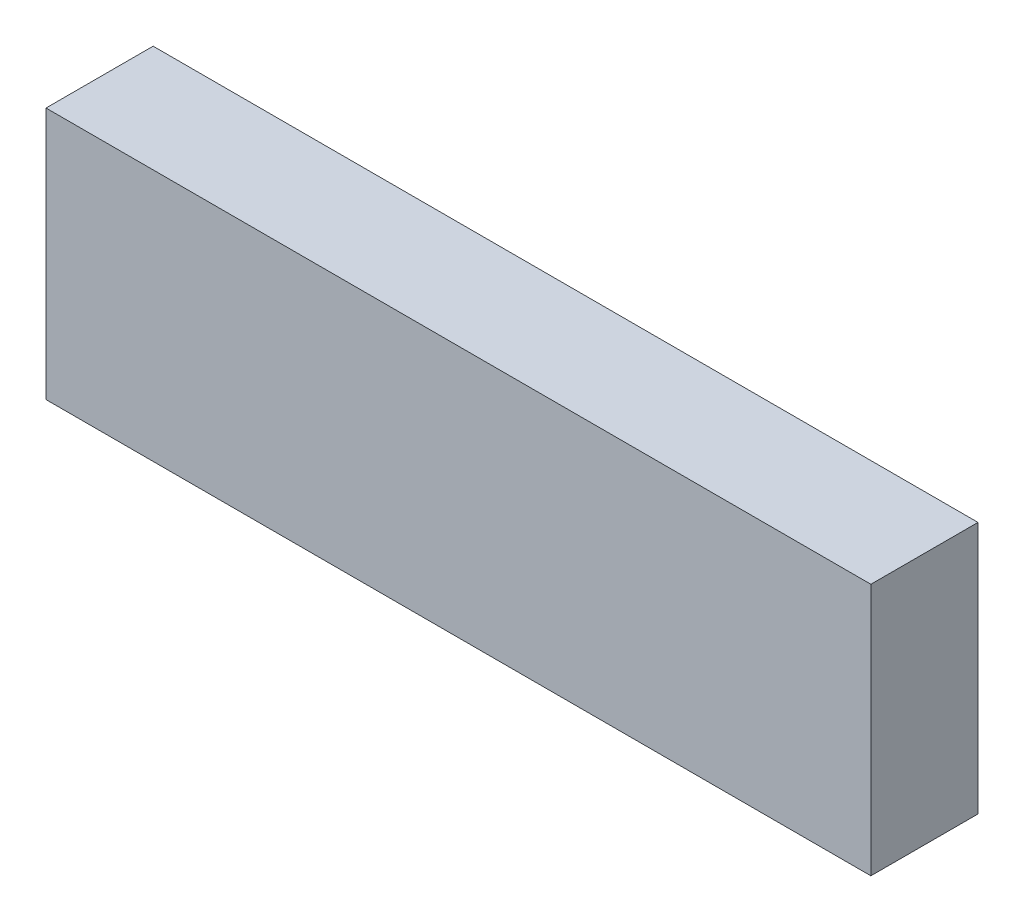
ISO-10303-21;
HEADER;
FILE_DESCRIPTION(('STEP AP214'),'2;1');
FILE_NAME('part.step','',(''),(''),'','','');
FILE_SCHEMA(('AUTOMOTIVE_DESIGN { 1 0 10303 214 1 1 1 1 }'));
ENDSEC;
DATA;
#1=APPLICATION_CONTEXT('core data for automotive mechanical design processes');
#2=APPLICATION_PROTOCOL_DEFINITION('international standard','automotive_design',2000,#1);
#3=PRODUCT_CONTEXT('',#1,'mechanical');
#4=PRODUCT('Part','Part','',(#3));
#5=PRODUCT_RELATED_PRODUCT_CATEGORY('part','',(#4));
#6=PRODUCT_DEFINITION_FORMATION('','',#4);
#7=PRODUCT_DEFINITION_CONTEXT('part definition',#1,'design');
#8=PRODUCT_DEFINITION('design','',#6,#7);
#9=PRODUCT_DEFINITION_SHAPE('','',#8);
#10=(LENGTH_UNIT() NAMED_UNIT(*) SI_UNIT(.MILLI.,.METRE.));
#11=(NAMED_UNIT(*) PLANE_ANGLE_UNIT() SI_UNIT($,.RADIAN.));
#12=(NAMED_UNIT(*) SI_UNIT($,.STERADIAN.) SOLID_ANGLE_UNIT());
#13=UNCERTAINTY_MEASURE_WITH_UNIT(LENGTH_MEASURE(1.E-05),#10,'distance_accuracy_value','');
#14=(GEOMETRIC_REPRESENTATION_CONTEXT(3) GLOBAL_UNCERTAINTY_ASSIGNED_CONTEXT((#13)) GLOBAL_UNIT_ASSIGNED_CONTEXT((#10,
#11,#12)) REPRESENTATION_CONTEXT('',''));
#15=CARTESIAN_POINT('',(0.,0.,0.));
#16=DIRECTION('',(0.,0.,1.));
#17=DIRECTION('',(1.,0.,0.));
#18=AXIS2_PLACEMENT_3D('',#15,#16,#17);
#19=CARTESIAN_POINT('',(-68.453,-20.955,17.78));
#20=DIRECTION('',(1.,0.,0.));
#21=DIRECTION('',(0.,0.,-1.));
#22=AXIS2_PLACEMENT_3D('',#19,#20,#21);
#23=PLANE('',#22);
#24=DIRECTION('',(0.,-1.,0.));
#25=VECTOR('',#24,1.);
#26=CARTESIAN_POINT('',(-68.453,-20.955,0.));
#27=LINE('',#26,#25);
#28=CARTESIAN_POINT('',(-68.453,20.955,0.));
#29=VERTEX_POINT('',#28);
#30=CARTESIAN_POINT('',(-68.453,-20.955,0.));
#31=VERTEX_POINT('',#30);
#32=EDGE_CURVE('E98',#29,#31,#27,.T.);
#33=ORIENTED_EDGE('',*,*,#32,.T.);
#34=DIRECTION('',(0.,0.,-1.));
#35=VECTOR('',#34,1.);
#36=CARTESIAN_POINT('',(-68.453,-20.955,17.78));
#37=LINE('',#36,#35);
#38=CARTESIAN_POINT('',(-68.453,-20.955,17.78));
#39=VERTEX_POINT('',#38);
#40=EDGE_CURVE('E11',#39,#31,#37,.T.);
#41=ORIENTED_EDGE('',*,*,#40,.F.);
#42=DIRECTION('',(0.,-1.,0.));
#43=VECTOR('',#42,1.);
#44=CARTESIAN_POINT('',(-68.453,-20.955,17.78));
#45=LINE('',#44,#43);
#46=CARTESIAN_POINT('',(-68.453,20.955,17.78));
#47=VERTEX_POINT('',#46);
#48=EDGE_CURVE('E86',#47,#39,#45,.T.);
#49=ORIENTED_EDGE('',*,*,#48,.F.);
#50=DIRECTION('',(0.,0.,-1.));
#51=VECTOR('',#50,1.);
#52=CARTESIAN_POINT('',(-68.453,20.955,17.78));
#53=LINE('',#52,#51);
#54=EDGE_CURVE('E94',#47,#29,#53,.T.);
#55=ORIENTED_EDGE('',*,*,#54,.T.);
#56=EDGE_LOOP('',(#33,#41,#49,#55));
#57=FACE_BOUND('',#56,.T.);
#58=ADVANCED_FACE('F35',(#57),#23,.F.);
#59=CARTESIAN_POINT('',(68.453,-20.955,17.78));
#60=DIRECTION('',(0.,1.,0.));
#61=DIRECTION('',(-1.,0.,0.));
#62=AXIS2_PLACEMENT_3D('',#59,#60,#61);
#63=PLANE('',#62);
#64=DIRECTION('',(1.,0.,0.));
#65=VECTOR('',#64,1.);
#66=CARTESIAN_POINT('',(68.453,-20.955,0.));
#67=LINE('',#66,#65);
#68=CARTESIAN_POINT('',(68.453,-20.955,0.));
#69=VERTEX_POINT('',#68);
#70=EDGE_CURVE('E90',#31,#69,#67,.T.);
#71=ORIENTED_EDGE('',*,*,#70,.T.);
#72=DIRECTION('',(0.,0.,-1.));
#73=VECTOR('',#72,1.);
#74=CARTESIAN_POINT('',(68.453,-20.955,17.78));
#75=LINE('',#74,#73);
#76=CARTESIAN_POINT('',(68.453,-20.955,17.78));
#77=VERTEX_POINT('',#76);
#78=EDGE_CURVE('E43',#77,#69,#75,.T.);
#79=ORIENTED_EDGE('',*,*,#78,.F.);
#80=DIRECTION('',(1.,0.,0.));
#81=VECTOR('',#80,1.);
#82=CARTESIAN_POINT('',(68.453,-20.955,17.78));
#83=LINE('',#82,#81);
#84=EDGE_CURVE('E81',#39,#77,#83,.T.);
#85=ORIENTED_EDGE('',*,*,#84,.F.);
#86=ORIENTED_EDGE('',*,*,#40,.T.);
#87=EDGE_LOOP('',(#71,#79,#85,#86));
#88=FACE_BOUND('',#87,.T.);
#89=ADVANCED_FACE('F89',(#88),#63,.F.);
#90=CARTESIAN_POINT('',(68.453,-20.955,17.78));
#91=DIRECTION('',(-1.,0.,0.));
#92=DIRECTION('',(0.,0.,1.));
#93=AXIS2_PLACEMENT_3D('',#90,#91,#92);
#94=PLANE('',#93);
#95=DIRECTION('',(0.,1.,0.));
#96=VECTOR('',#95,1.);
#97=CARTESIAN_POINT('',(68.453,-20.955,0.));
#98=LINE('',#97,#96);
#99=CARTESIAN_POINT('',(68.453,20.955,0.));
#100=VERTEX_POINT('',#99);
#101=EDGE_CURVE('E68',#69,#100,#98,.T.);
#102=ORIENTED_EDGE('',*,*,#101,.T.);
#103=DIRECTION('',(0.,0.,-1.));
#104=VECTOR('',#103,1.);
#105=CARTESIAN_POINT('',(68.453,20.955,17.78));
#106=LINE('',#105,#104);
#107=CARTESIAN_POINT('',(68.453,20.955,17.78));
#108=VERTEX_POINT('',#107);
#109=EDGE_CURVE('E91',#108,#100,#106,.T.);
#110=ORIENTED_EDGE('',*,*,#109,.F.);
#111=DIRECTION('',(0.,1.,0.));
#112=VECTOR('',#111,1.);
#113=CARTESIAN_POINT('',(68.453,-20.955,17.78));
#114=LINE('',#113,#112);
#115=EDGE_CURVE('E84',#77,#108,#114,.T.);
#116=ORIENTED_EDGE('',*,*,#115,.F.);
#117=ORIENTED_EDGE('',*,*,#78,.T.);
#118=EDGE_LOOP('',(#102,#110,#116,#117));
#119=FACE_BOUND('',#118,.T.);
#120=ADVANCED_FACE('F92',(#119),#94,.F.);
#121=CARTESIAN_POINT('',(68.453,20.955,17.78));
#122=DIRECTION('',(0.,-1.,0.));
#123=DIRECTION('',(1.,0.,0.));
#124=AXIS2_PLACEMENT_3D('',#121,#122,#123);
#125=PLANE('',#124);
#126=DIRECTION('',(-1.,0.,0.));
#127=VECTOR('',#126,1.);
#128=CARTESIAN_POINT('',(68.453,20.955,0.));
#129=LINE('',#128,#127);
#130=EDGE_CURVE('E74',#100,#29,#129,.T.);
#131=ORIENTED_EDGE('',*,*,#130,.T.);
#132=ORIENTED_EDGE('',*,*,#54,.F.);
#133=DIRECTION('',(-1.,0.,0.));
#134=VECTOR('',#133,1.);
#135=CARTESIAN_POINT('',(68.453,20.955,17.78));
#136=LINE('',#135,#134);
#137=EDGE_CURVE('E51',#108,#47,#136,.T.);
#138=ORIENTED_EDGE('',*,*,#137,.F.);
#139=ORIENTED_EDGE('',*,*,#109,.T.);
#140=EDGE_LOOP('',(#131,#132,#138,#139));
#141=FACE_BOUND('',#140,.T.);
#142=ADVANCED_FACE('F105',(#141),#125,.F.);
#143=CARTESIAN_POINT('',(0.,0.,17.78));
#144=DIRECTION('',(0.,0.,1.));
#145=DIRECTION('',(1.,0.,0.));
#146=AXIS2_PLACEMENT_3D('',#143,#144,#145);
#147=PLANE('',#146);
#148=ORIENTED_EDGE('',*,*,#48,.T.);
#149=ORIENTED_EDGE('',*,*,#84,.T.);
#150=ORIENTED_EDGE('',*,*,#115,.T.);
#151=ORIENTED_EDGE('',*,*,#137,.T.);
#152=EDGE_LOOP('',(#148,#149,#150,#151));
#153=FACE_BOUND('',#152,.T.);
#154=ADVANCED_FACE('F82',(#153),#147,.T.);
#155=CARTESIAN_POINT('',(0.,0.,0.));
#156=DIRECTION('',(0.,0.,1.));
#157=DIRECTION('',(1.,0.,0.));
#158=AXIS2_PLACEMENT_3D('',#155,#156,#157);
#159=PLANE('',#158);
#160=ORIENTED_EDGE('',*,*,#32,.F.);
#161=ORIENTED_EDGE('',*,*,#130,.F.);
#162=ORIENTED_EDGE('',*,*,#101,.F.);
#163=ORIENTED_EDGE('',*,*,#70,.F.);
#164=EDGE_LOOP('',(#160,#161,#162,#163));
#165=FACE_BOUND('',#164,.T.);
#166=ADVANCED_FACE('F108',(#165),#159,.F.);
#167=CLOSED_SHELL('',(#58,#89,#120,#142,#154,#166));
#168=MANIFOLD_SOLID_BREP('B2',#167);
#169=ADVANCED_BREP_SHAPE_REPRESENTATION('',(#18,#168),#14);
#170=SHAPE_DEFINITION_REPRESENTATION(#9,#169);
ENDSEC;
END-ISO-10303-21;
